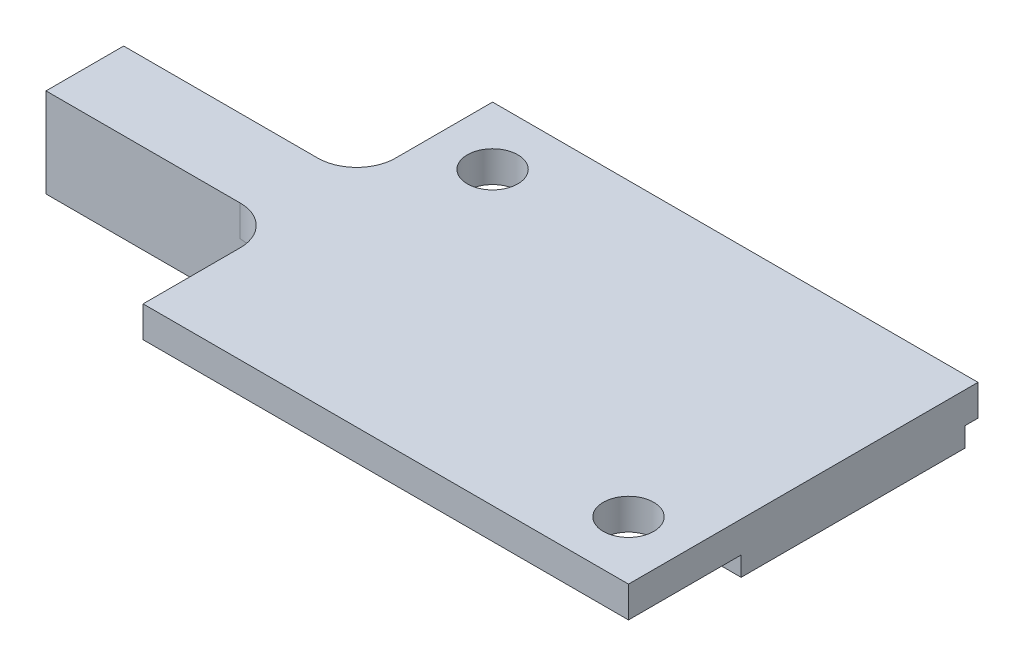
ISO-10303-21;
HEADER;
FILE_DESCRIPTION(('STEP AP214'),'2;1');
FILE_NAME('part.step','',(''),(''),'','','');
FILE_SCHEMA(('AUTOMOTIVE_DESIGN { 1 0 10303 214 1 1 1 1 }'));
ENDSEC;
DATA;
#1=APPLICATION_CONTEXT('core data for automotive mechanical design processes');
#2=APPLICATION_PROTOCOL_DEFINITION('international standard','automotive_design',2000,#1);
#3=PRODUCT_CONTEXT('',#1,'mechanical');
#4=PRODUCT('Part','Part','',(#3));
#5=PRODUCT_RELATED_PRODUCT_CATEGORY('part','',(#4));
#6=PRODUCT_DEFINITION_FORMATION('','',#4);
#7=PRODUCT_DEFINITION_CONTEXT('part definition',#1,'design');
#8=PRODUCT_DEFINITION('design','',#6,#7);
#9=PRODUCT_DEFINITION_SHAPE('','',#8);
#10=(LENGTH_UNIT() NAMED_UNIT(*) SI_UNIT(.MILLI.,.METRE.));
#11=(NAMED_UNIT(*) PLANE_ANGLE_UNIT() SI_UNIT($,.RADIAN.));
#12=(NAMED_UNIT(*) SI_UNIT($,.STERADIAN.) SOLID_ANGLE_UNIT());
#13=UNCERTAINTY_MEASURE_WITH_UNIT(LENGTH_MEASURE(1.E-05),#10,'distance_accuracy_value','');
#14=(GEOMETRIC_REPRESENTATION_CONTEXT(3) GLOBAL_UNCERTAINTY_ASSIGNED_CONTEXT((#13)) GLOBAL_UNIT_ASSIGNED_CONTEXT((#10,
#11,#12)) REPRESENTATION_CONTEXT('',''));
#15=CARTESIAN_POINT('',(0.,0.,0.));
#16=DIRECTION('',(0.,0.,1.));
#17=DIRECTION('',(1.,0.,0.));
#18=AXIS2_PLACEMENT_3D('',#15,#16,#17);
#19=CARTESIAN_POINT('',(0.,0.,0.));
#20=DIRECTION('',(0.,1.,0.));
#21=DIRECTION('',(0.,0.,1.));
#22=AXIS2_PLACEMENT_3D('',#19,#20,#21);
#23=PLANE('',#22);
#24=CARTESIAN_POINT('',(22.,0.,-3.));
#25=DIRECTION('',(0.,1.,0.));
#26=DIRECTION('',(0.,0.,1.));
#27=AXIS2_PLACEMENT_3D('',#24,#25,#26);
#28=CIRCLE('',#27,1.3);
#29=CARTESIAN_POINT('',(22.,0.,-1.7));
#30=VERTEX_POINT('',#29);
#31=EDGE_CURVE('E188',#30,#30,#28,.T.);
#32=ORIENTED_EDGE('',*,*,#31,.T.);
#33=EDGE_LOOP('',(#32));
#34=FACE_BOUND('',#33,.T.);
#35=CARTESIAN_POINT('',(3.,0.,-15.));
#36=DIRECTION('',(0.,1.,0.));
#37=DIRECTION('',(0.,0.,1.));
#38=AXIS2_PLACEMENT_3D('',#35,#36,#37);
#39=CIRCLE('',#38,1.3);
#40=CARTESIAN_POINT('',(3.,0.,-13.7));
#41=VERTEX_POINT('',#40);
#42=EDGE_CURVE('E194',#41,#41,#39,.T.);
#43=ORIENTED_EDGE('',*,*,#42,.T.);
#44=EDGE_LOOP('',(#43));
#45=FACE_BOUND('',#44,.T.);
#46=DIRECTION('',(-1.,0.,0.));
#47=VECTOR('',#46,1.);
#48=CARTESIAN_POINT('',(23.,0.,-5.8));
#49=LINE('',#48,#47);
#50=CARTESIAN_POINT('',(25.,0.,-5.8));
#51=VERTEX_POINT('',#50);
#52=CARTESIAN_POINT('',(23.,0.,-5.8));
#53=VERTEX_POINT('',#52);
#54=EDGE_CURVE('E183',#51,#53,#49,.T.);
#55=ORIENTED_EDGE('',*,*,#54,.F.);
#56=DIRECTION('',(0.,0.,-1.));
#57=VECTOR('',#56,1.);
#58=CARTESIAN_POINT('',(25.,0.,0.));
#59=LINE('',#58,#57);
#60=CARTESIAN_POINT('',(25.,0.,0.));
#61=VERTEX_POINT('',#60);
#62=EDGE_CURVE('E247',#61,#51,#59,.T.);
#63=ORIENTED_EDGE('',*,*,#62,.F.);
#64=DIRECTION('',(1.,0.,0.));
#65=VECTOR('',#64,1.);
#66=CARTESIAN_POINT('',(0.,0.,0.));
#67=LINE('',#66,#65);
#68=CARTESIAN_POINT('',(0.,0.,0.));
#69=VERTEX_POINT('',#68);
#70=EDGE_CURVE('E244',#69,#61,#67,.T.);
#71=ORIENTED_EDGE('',*,*,#70,.F.);
#72=DIRECTION('',(0.,0.,1.));
#73=VECTOR('',#72,1.);
#74=CARTESIAN_POINT('',(0.,0.,0.));
#75=LINE('',#74,#73);
#76=CARTESIAN_POINT('',(0.,0.,-5.));
#77=VERTEX_POINT('',#76);
#78=EDGE_CURVE('E211',#77,#69,#75,.T.);
#79=ORIENTED_EDGE('',*,*,#78,.F.);
#80=CARTESIAN_POINT('',(-2.,0.,-5.));
#81=DIRECTION('',(0.,1.,0.));
#82=DIRECTION('',(0.,0.,1.));
#83=AXIS2_PLACEMENT_3D('',#80,#81,#82);
#84=CIRCLE('',#83,2.);
#85=CARTESIAN_POINT('',(-2.,0.,-7.));
#86=VERTEX_POINT('',#85);
#87=EDGE_CURVE('E282',#77,#86,#84,.T.);
#88=ORIENTED_EDGE('',*,*,#87,.T.);
#89=DIRECTION('',(-1.,0.,0.));
#90=VECTOR('',#89,1.);
#91=CARTESIAN_POINT('',(0.,0.,-7.));
#92=LINE('',#91,#90);
#93=CARTESIAN_POINT('',(0.,0.,-7.));
#94=VERTEX_POINT('',#93);
#95=EDGE_CURVE('E65',#94,#86,#92,.T.);
#96=ORIENTED_EDGE('',*,*,#95,.F.);
#97=DIRECTION('',(0.,0.,1.));
#98=VECTOR('',#97,1.);
#99=CARTESIAN_POINT('',(0.,0.,0.));
#100=LINE('',#99,#98);
#101=CARTESIAN_POINT('',(0.,0.,-11.));
#102=VERTEX_POINT('',#101);
#103=EDGE_CURVE('E212',#102,#94,#100,.T.);
#104=ORIENTED_EDGE('',*,*,#103,.F.);
#105=DIRECTION('',(1.,0.,0.));
#106=VECTOR('',#105,1.);
#107=CARTESIAN_POINT('',(0.,0.,-11.));
#108=LINE('',#107,#106);
#109=CARTESIAN_POINT('',(-2.,0.,-11.));
#110=VERTEX_POINT('',#109);
#111=EDGE_CURVE('E275',#110,#102,#108,.T.);
#112=ORIENTED_EDGE('',*,*,#111,.F.);
#113=CARTESIAN_POINT('',(-2.,0.,-13.));
#114=DIRECTION('',(0.,1.,0.));
#115=DIRECTION('',(0.,0.,1.));
#116=AXIS2_PLACEMENT_3D('',#113,#114,#115);
#117=CIRCLE('',#116,2.);
#118=CARTESIAN_POINT('',(0.,0.,-13.));
#119=VERTEX_POINT('',#118);
#120=EDGE_CURVE('E50',#110,#119,#117,.T.);
#121=ORIENTED_EDGE('',*,*,#120,.T.);
#122=DIRECTION('',(0.,0.,1.));
#123=VECTOR('',#122,1.);
#124=CARTESIAN_POINT('',(0.,0.,-11.));
#125=LINE('',#124,#123);
#126=CARTESIAN_POINT('',(0.,0.,-18.));
#127=VERTEX_POINT('',#126);
#128=EDGE_CURVE('E226',#127,#119,#125,.T.);
#129=ORIENTED_EDGE('',*,*,#128,.F.);
#130=DIRECTION('',(-1.,0.,0.));
#131=VECTOR('',#130,1.);
#132=CARTESIAN_POINT('',(0.,0.,-18.));
#133=LINE('',#132,#131);
#134=CARTESIAN_POINT('',(25.,0.,-18.));
#135=VERTEX_POINT('',#134);
#136=EDGE_CURVE('E250',#135,#127,#133,.T.);
#137=ORIENTED_EDGE('',*,*,#136,.F.);
#138=CARTESIAN_POINT('',(25.,0.,-17.33));
#139=VERTEX_POINT('',#138);
#140=EDGE_CURVE('E246',#139,#135,#59,.T.);
#141=ORIENTED_EDGE('',*,*,#140,.F.);
#142=DIRECTION('',(0.897979896392293,0.,-0.440036482209472));
#143=VECTOR('',#142,1.);
#144=CARTESIAN_POINT('',(25.,0.,-17.33));
#145=LINE('',#144,#143);
#146=CARTESIAN_POINT('',(20.2856055439405,0.,-15.0198084684003));
#147=VERTEX_POINT('',#146);
#148=EDGE_CURVE('E179',#147,#139,#145,.T.);
#149=ORIENTED_EDGE('',*,*,#148,.F.);
#150=DIRECTION('',(-0.662047428307204,0.,-0.74946194211035));
#151=VECTOR('',#150,1.);
#152=CARTESIAN_POINT('',(20.2856055439405,0.,-15.0198084684003));
#153=LINE('',#152,#151);
#154=CARTESIAN_POINT('',(23.,0.,-11.9470145057478));
#155=VERTEX_POINT('',#154);
#156=EDGE_CURVE('E335',#155,#147,#153,.T.);
#157=ORIENTED_EDGE('',*,*,#156,.F.);
#158=DIRECTION('',(0.,0.,-1.));
#159=VECTOR('',#158,1.);
#160=CARTESIAN_POINT('',(23.,0.,-11.9470145057478));
#161=LINE('',#160,#159);
#162=EDGE_CURVE('E339',#53,#155,#161,.T.);
#163=ORIENTED_EDGE('',*,*,#162,.F.);
#164=EDGE_LOOP('',(#55,#63,#71,#79,#88,#96,#104,#112,#121,#129,#137,#141,#149,#157,#163));
#165=FACE_BOUND('',#164,.T.);
#166=ADVANCED_FACE('F42',(#34,#45,#165),#23,.F.);
#167=CARTESIAN_POINT('',(0.,1.6,0.));
#168=DIRECTION('',(1.,0.,0.));
#169=DIRECTION('',(0.,0.,-1.));
#170=AXIS2_PLACEMENT_3D('',#167,#168,#169);
#171=PLANE('',#170);
#172=DIRECTION('',(0.,0.,1.));
#173=VECTOR('',#172,1.);
#174=CARTESIAN_POINT('',(0.,1.6,0.));
#175=LINE('',#174,#173);
#176=CARTESIAN_POINT('',(0.,1.6,-5.));
#177=VERTEX_POINT('',#176);
#178=CARTESIAN_POINT('',(0.,1.6,0.));
#179=VERTEX_POINT('',#178);
#180=EDGE_CURVE('E223',#177,#179,#175,.T.);
#181=ORIENTED_EDGE('',*,*,#180,.F.);
#182=DIRECTION('',(0.,-1.,0.));
#183=VECTOR('',#182,1.);
#184=CARTESIAN_POINT('',(0.,0.,-5.));
#185=LINE('',#184,#183);
#186=EDGE_CURVE('E269',#177,#77,#185,.T.);
#187=ORIENTED_EDGE('',*,*,#186,.T.);
#188=ORIENTED_EDGE('',*,*,#78,.T.);
#189=DIRECTION('',(0.,-1.,0.));
#190=VECTOR('',#189,1.);
#191=CARTESIAN_POINT('',(0.,1.6,0.));
#192=LINE('',#191,#190);
#193=EDGE_CURVE('E266',#179,#69,#192,.T.);
#194=ORIENTED_EDGE('',*,*,#193,.F.);
#195=EDGE_LOOP('',(#181,#187,#188,#194));
#196=FACE_BOUND('',#195,.T.);
#197=ADVANCED_FACE('F318',(#196),#171,.F.);
#198=CARTESIAN_POINT('',(0.,1.6,0.));
#199=DIRECTION('',(0.,0.,-1.));
#200=DIRECTION('',(-1.,0.,0.));
#201=AXIS2_PLACEMENT_3D('',#198,#199,#200);
#202=PLANE('',#201);
#203=ORIENTED_EDGE('',*,*,#70,.T.);
#204=DIRECTION('',(0.,-1.,0.));
#205=VECTOR('',#204,1.);
#206=CARTESIAN_POINT('',(25.,1.6,0.));
#207=LINE('',#206,#205);
#208=CARTESIAN_POINT('',(25.,1.6,0.));
#209=VERTEX_POINT('',#208);
#210=EDGE_CURVE('E263',#209,#61,#207,.T.);
#211=ORIENTED_EDGE('',*,*,#210,.F.);
#212=DIRECTION('',(1.,0.,0.));
#213=VECTOR('',#212,1.);
#214=CARTESIAN_POINT('',(0.,1.6,0.));
#215=LINE('',#214,#213);
#216=EDGE_CURVE('E225',#179,#209,#215,.T.);
#217=ORIENTED_EDGE('',*,*,#216,.F.);
#218=ORIENTED_EDGE('',*,*,#193,.T.);
#219=EDGE_LOOP('',(#203,#211,#217,#218));
#220=FACE_BOUND('',#219,.T.);
#221=ADVANCED_FACE('F325',(#220),#202,.F.);
#222=CARTESIAN_POINT('',(25.,1.6,0.));
#223=DIRECTION('',(-1.,0.,0.));
#224=DIRECTION('',(0.,0.,1.));
#225=AXIS2_PLACEMENT_3D('',#222,#223,#224);
#226=PLANE('',#225);
#227=ORIENTED_EDGE('',*,*,#62,.T.);
#228=DIRECTION('',(0.,1.,0.));
#229=VECTOR('',#228,1.);
#230=CARTESIAN_POINT('',(25.,-1.,-5.8));
#231=LINE('',#230,#229);
#232=CARTESIAN_POINT('',(25.,-1.,-5.8));
#233=VERTEX_POINT('',#232);
#234=EDGE_CURVE('E343',#233,#51,#231,.T.);
#235=ORIENTED_EDGE('',*,*,#234,.F.);
#236=DIRECTION('',(0.,0.,1.));
#237=VECTOR('',#236,1.);
#238=CARTESIAN_POINT('',(25.,-1.,-5.8));
#239=LINE('',#238,#237);
#240=CARTESIAN_POINT('',(25.,-1.,-17.33));
#241=VERTEX_POINT('',#240);
#242=EDGE_CURVE('E176',#241,#233,#239,.T.);
#243=ORIENTED_EDGE('',*,*,#242,.F.);
#244=DIRECTION('',(0.,1.,0.));
#245=VECTOR('',#244,1.);
#246=CARTESIAN_POINT('',(25.,-1.,-17.33));
#247=LINE('',#246,#245);
#248=EDGE_CURVE('E57',#241,#139,#247,.T.);
#249=ORIENTED_EDGE('',*,*,#248,.T.);
#250=ORIENTED_EDGE('',*,*,#140,.T.);
#251=DIRECTION('',(0.,-1.,0.));
#252=VECTOR('',#251,1.);
#253=CARTESIAN_POINT('',(25.,1.6,-18.));
#254=LINE('',#253,#252);
#255=CARTESIAN_POINT('',(25.,1.6,-18.));
#256=VERTEX_POINT('',#255);
#257=EDGE_CURVE('E260',#256,#135,#254,.T.);
#258=ORIENTED_EDGE('',*,*,#257,.F.);
#259=DIRECTION('',(0.,0.,-1.));
#260=VECTOR('',#259,1.);
#261=CARTESIAN_POINT('',(25.,1.6,0.));
#262=LINE('',#261,#260);
#263=EDGE_CURVE('E228',#209,#256,#262,.T.);
#264=ORIENTED_EDGE('',*,*,#263,.F.);
#265=ORIENTED_EDGE('',*,*,#210,.T.);
#266=EDGE_LOOP('',(#227,#235,#243,#249,#250,#258,#264,#265));
#267=FACE_BOUND('',#266,.T.);
#268=ADVANCED_FACE('F329',(#267),#226,.F.);
#269=CARTESIAN_POINT('',(0.,1.6,-18.));
#270=DIRECTION('',(0.,0.,1.));
#271=DIRECTION('',(1.,0.,0.));
#272=AXIS2_PLACEMENT_3D('',#269,#270,#271);
#273=PLANE('',#272);
#274=ORIENTED_EDGE('',*,*,#136,.T.);
#275=DIRECTION('',(0.,-1.,0.));
#276=VECTOR('',#275,1.);
#277=CARTESIAN_POINT('',(0.,1.6,-18.));
#278=LINE('',#277,#276);
#279=CARTESIAN_POINT('',(0.,1.6,-18.));
#280=VERTEX_POINT('',#279);
#281=EDGE_CURVE('E257',#280,#127,#278,.T.);
#282=ORIENTED_EDGE('',*,*,#281,.F.);
#283=DIRECTION('',(-1.,0.,0.));
#284=VECTOR('',#283,1.);
#285=CARTESIAN_POINT('',(0.,1.6,-18.));
#286=LINE('',#285,#284);
#287=EDGE_CURVE('E230',#256,#280,#286,.T.);
#288=ORIENTED_EDGE('',*,*,#287,.F.);
#289=ORIENTED_EDGE('',*,*,#257,.T.);
#290=EDGE_LOOP('',(#274,#282,#288,#289));
#291=FACE_BOUND('',#290,.T.);
#292=ADVANCED_FACE('F332',(#291),#273,.F.);
#293=CARTESIAN_POINT('',(0.,1.6,-11.));
#294=DIRECTION('',(1.,0.,0.));
#295=DIRECTION('',(0.,0.,-1.));
#296=AXIS2_PLACEMENT_3D('',#293,#294,#295);
#297=PLANE('',#296);
#298=ORIENTED_EDGE('',*,*,#128,.T.);
#299=DIRECTION('',(0.,-1.,0.));
#300=VECTOR('',#299,1.);
#301=CARTESIAN_POINT('',(0.,1.6,-13.));
#302=LINE('',#301,#300);
#303=CARTESIAN_POINT('',(0.,1.6,-13.));
#304=VERTEX_POINT('',#303);
#305=EDGE_CURVE('E280',#119,#304,#302,.F.);
#306=ORIENTED_EDGE('',*,*,#305,.T.);
#307=DIRECTION('',(0.,0.,1.));
#308=VECTOR('',#307,1.);
#309=CARTESIAN_POINT('',(0.,1.6,-11.));
#310=LINE('',#309,#308);
#311=EDGE_CURVE('E232',#280,#304,#310,.T.);
#312=ORIENTED_EDGE('',*,*,#311,.F.);
#313=ORIENTED_EDGE('',*,*,#281,.T.);
#314=EDGE_LOOP('',(#298,#306,#312,#313));
#315=FACE_BOUND('',#314,.T.);
#316=ADVANCED_FACE('F292',(#315),#297,.F.);
#317=CARTESIAN_POINT('',(0.,1.6,-11.));
#318=DIRECTION('',(0.,0.,1.));
#319=DIRECTION('',(1.,0.,0.));
#320=AXIS2_PLACEMENT_3D('',#317,#318,#319);
#321=PLANE('',#320);
#322=DIRECTION('',(-1.,0.,0.));
#323=VECTOR('',#322,1.);
#324=CARTESIAN_POINT('',(0.,1.6,-11.));
#325=LINE('',#324,#323);
#326=CARTESIAN_POINT('',(-2.,1.6,-11.));
#327=VERTEX_POINT('',#326);
#328=CARTESIAN_POINT('',(-12.,1.6,-11.));
#329=VERTEX_POINT('',#328);
#330=EDGE_CURVE('E235',#327,#329,#325,.T.);
#331=ORIENTED_EDGE('',*,*,#330,.F.);
#332=DIRECTION('',(0.,-1.,0.));
#333=VECTOR('',#332,1.);
#334=CARTESIAN_POINT('',(-2.,0.,-11.));
#335=LINE('',#334,#333);
#336=EDGE_CURVE('E277',#327,#110,#335,.T.);
#337=ORIENTED_EDGE('',*,*,#336,.T.);
#338=ORIENTED_EDGE('',*,*,#111,.T.);
#339=DIRECTION('',(0.,1.,0.));
#340=VECTOR('',#339,1.);
#341=CARTESIAN_POINT('',(0.,0.,-11.));
#342=LINE('',#341,#340);
#343=CARTESIAN_POINT('',(0.,-3.,-11.));
#344=VERTEX_POINT('',#343);
#345=EDGE_CURVE('E216',#344,#102,#342,.T.);
#346=ORIENTED_EDGE('',*,*,#345,.F.);
#347=DIRECTION('',(-1.,0.,0.));
#348=VECTOR('',#347,1.);
#349=CARTESIAN_POINT('',(5.,-3.,-11.));
#350=LINE('',#349,#348);
#351=CARTESIAN_POINT('',(-12.,-3.,-11.));
#352=VERTEX_POINT('',#351);
#353=EDGE_CURVE('E206',#344,#352,#350,.T.);
#354=ORIENTED_EDGE('',*,*,#353,.T.);
#355=DIRECTION('',(0.,-1.,0.));
#356=VECTOR('',#355,1.);
#357=CARTESIAN_POINT('',(-12.,1.6,-11.));
#358=LINE('',#357,#356);
#359=EDGE_CURVE('E255',#329,#352,#358,.T.);
#360=ORIENTED_EDGE('',*,*,#359,.F.);
#361=EDGE_LOOP('',(#331,#337,#338,#346,#354,#360));
#362=FACE_BOUND('',#361,.T.);
#363=ADVANCED_FACE('F301',(#362),#321,.F.);
#364=CARTESIAN_POINT('',(-12.,1.6,-7.));
#365=DIRECTION('',(1.,0.,0.));
#366=DIRECTION('',(0.,0.,-1.));
#367=AXIS2_PLACEMENT_3D('',#364,#365,#366);
#368=PLANE('',#367);
#369=ORIENTED_EDGE('',*,*,#359,.T.);
#370=CARTESIAN_POINT('',(-12.,-3.,-9.));
#371=DIRECTION('',(-1.,0.,0.));
#372=DIRECTION('',(0.,0.,1.));
#373=AXIS2_PLACEMENT_3D('',#370,#371,#372);
#374=CIRCLE('',#373,2.);
#375=CARTESIAN_POINT('',(-12.,-3.,-7.));
#376=VERTEX_POINT('',#375);
#377=EDGE_CURVE('E203',#376,#352,#374,.T.);
#378=ORIENTED_EDGE('',*,*,#377,.F.);
#379=DIRECTION('',(0.,-1.,0.));
#380=VECTOR('',#379,1.);
#381=CARTESIAN_POINT('',(-12.,1.6,-7.));
#382=LINE('',#381,#380);
#383=CARTESIAN_POINT('',(-12.,1.6,-7.));
#384=VERTEX_POINT('',#383);
#385=EDGE_CURVE('E242',#384,#376,#382,.T.);
#386=ORIENTED_EDGE('',*,*,#385,.F.);
#387=DIRECTION('',(0.,0.,1.));
#388=VECTOR('',#387,1.);
#389=CARTESIAN_POINT('',(-12.,1.6,-7.));
#390=LINE('',#389,#388);
#391=EDGE_CURVE('E237',#329,#384,#390,.T.);
#392=ORIENTED_EDGE('',*,*,#391,.F.);
#393=EDGE_LOOP('',(#369,#378,#386,#392));
#394=FACE_BOUND('',#393,.T.);
#395=ADVANCED_FACE('F307',(#394),#368,.F.);
#396=CARTESIAN_POINT('',(0.,1.6,-7.));
#397=DIRECTION('',(0.,0.,-1.));
#398=DIRECTION('',(-1.,0.,0.));
#399=AXIS2_PLACEMENT_3D('',#396,#397,#398);
#400=PLANE('',#399);
#401=DIRECTION('',(0.,1.,0.));
#402=VECTOR('',#401,1.);
#403=CARTESIAN_POINT('',(0.,0.,-7.));
#404=LINE('',#403,#402);
#405=CARTESIAN_POINT('',(0.,-3.,-7.));
#406=VERTEX_POINT('',#405);
#407=EDGE_CURVE('E197',#406,#94,#404,.T.);
#408=ORIENTED_EDGE('',*,*,#407,.T.);
#409=ORIENTED_EDGE('',*,*,#95,.T.);
#410=DIRECTION('',(0.,-1.,0.));
#411=VECTOR('',#410,1.);
#412=CARTESIAN_POINT('',(-2.,1.6,-7.));
#413=LINE('',#412,#411);
#414=CARTESIAN_POINT('',(-2.,1.6,-7.));
#415=VERTEX_POINT('',#414);
#416=EDGE_CURVE('E272',#86,#415,#413,.F.);
#417=ORIENTED_EDGE('',*,*,#416,.T.);
#418=DIRECTION('',(1.,0.,0.));
#419=VECTOR('',#418,1.);
#420=CARTESIAN_POINT('',(0.,1.6,-7.));
#421=LINE('',#420,#419);
#422=EDGE_CURVE('E239',#384,#415,#421,.T.);
#423=ORIENTED_EDGE('',*,*,#422,.F.);
#424=ORIENTED_EDGE('',*,*,#385,.T.);
#425=DIRECTION('',(-1.,0.,0.));
#426=VECTOR('',#425,1.);
#427=CARTESIAN_POINT('',(5.,-3.,-7.));
#428=LINE('',#427,#426);
#429=EDGE_CURVE('E207',#406,#376,#428,.T.);
#430=ORIENTED_EDGE('',*,*,#429,.F.);
#431=EDGE_LOOP('',(#408,#409,#417,#423,#424,#430));
#432=FACE_BOUND('',#431,.T.);
#433=ADVANCED_FACE('F374',(#432),#400,.F.);
#434=CARTESIAN_POINT('',(0.,1.6,0.));
#435=DIRECTION('',(0.,1.,0.));
#436=DIRECTION('',(0.,0.,1.));
#437=AXIS2_PLACEMENT_3D('',#434,#435,#436);
#438=PLANE('',#437);
#439=CARTESIAN_POINT('',(3.,1.6,-15.));
#440=DIRECTION('',(0.,1.,0.));
#441=DIRECTION('',(0.,0.,1.));
#442=AXIS2_PLACEMENT_3D('',#439,#440,#441);
#443=CIRCLE('',#442,1.3);
#444=CARTESIAN_POINT('',(3.,1.6,-13.7));
#445=VERTEX_POINT('',#444);
#446=EDGE_CURVE('E198',#445,#445,#443,.T.);
#447=ORIENTED_EDGE('',*,*,#446,.F.);
#448=EDGE_LOOP('',(#447));
#449=FACE_BOUND('',#448,.T.);
#450=CARTESIAN_POINT('',(22.,1.6,-3.));
#451=DIRECTION('',(0.,1.,0.));
#452=DIRECTION('',(0.,0.,1.));
#453=AXIS2_PLACEMENT_3D('',#450,#451,#452);
#454=CIRCLE('',#453,1.3);
#455=CARTESIAN_POINT('',(22.,1.6,-1.7));
#456=VERTEX_POINT('',#455);
#457=EDGE_CURVE('E185',#456,#456,#454,.T.);
#458=ORIENTED_EDGE('',*,*,#457,.F.);
#459=EDGE_LOOP('',(#458));
#460=FACE_BOUND('',#459,.T.);
#461=ORIENTED_EDGE('',*,*,#422,.T.);
#462=CARTESIAN_POINT('',(-2.,1.6,-5.));
#463=DIRECTION('',(0.,1.,0.));
#464=DIRECTION('',(0.,0.,1.));
#465=AXIS2_PLACEMENT_3D('',#462,#463,#464);
#466=CIRCLE('',#465,2.);
#467=EDGE_CURVE('E284',#415,#177,#466,.F.);
#468=ORIENTED_EDGE('',*,*,#467,.T.);
#469=ORIENTED_EDGE('',*,*,#180,.T.);
#470=ORIENTED_EDGE('',*,*,#216,.T.);
#471=ORIENTED_EDGE('',*,*,#263,.T.);
#472=ORIENTED_EDGE('',*,*,#287,.T.);
#473=ORIENTED_EDGE('',*,*,#311,.T.);
#474=CARTESIAN_POINT('',(-2.,1.6,-13.));
#475=DIRECTION('',(0.,1.,0.));
#476=DIRECTION('',(0.,0.,1.));
#477=AXIS2_PLACEMENT_3D('',#474,#475,#476);
#478=CIRCLE('',#477,2.);
#479=EDGE_CURVE('E11',#304,#327,#478,.F.);
#480=ORIENTED_EDGE('',*,*,#479,.T.);
#481=ORIENTED_EDGE('',*,*,#330,.T.);
#482=ORIENTED_EDGE('',*,*,#391,.T.);
#483=EDGE_LOOP('',(#461,#468,#469,#470,#471,#472,#473,#480,#481,#482));
#484=FACE_BOUND('',#483,.T.);
#485=ADVANCED_FACE('F298',(#449,#460,#484),#438,.T.);
#486=CARTESIAN_POINT('',(5.,-3.,-9.));
#487=DIRECTION('',(-1.,0.,0.));
#488=DIRECTION('',(0.,0.,1.));
#489=AXIS2_PLACEMENT_3D('',#486,#487,#488);
#490=CYLINDRICAL_SURFACE('',#489,2.);
#491=CARTESIAN_POINT('',(0.,-3.,-9.));
#492=DIRECTION('',(1.,0.,0.));
#493=DIRECTION('',(0.,0.,-1.));
#494=AXIS2_PLACEMENT_3D('',#491,#492,#493);
#495=CIRCLE('',#494,2.);
#496=EDGE_CURVE('E208',#406,#344,#495,.F.);
#497=ORIENTED_EDGE('',*,*,#496,.F.);
#498=ORIENTED_EDGE('',*,*,#429,.T.);
#499=ORIENTED_EDGE('',*,*,#377,.T.);
#500=ORIENTED_EDGE('',*,*,#353,.F.);
#501=EDGE_LOOP('',(#497,#498,#499,#500));
#502=FACE_BOUND('',#501,.T.);
#503=ADVANCED_FACE('F407',(#502),#490,.F.);
#504=CARTESIAN_POINT('',(0.,1.6,-11.));
#505=DIRECTION('',(1.,0.,0.));
#506=DIRECTION('',(0.,0.,-1.));
#507=AXIS2_PLACEMENT_3D('',#504,#505,#506);
#508=PLANE('',#507);
#509=ORIENTED_EDGE('',*,*,#345,.T.);
#510=ORIENTED_EDGE('',*,*,#103,.T.);
#511=ORIENTED_EDGE('',*,*,#407,.F.);
#512=ORIENTED_EDGE('',*,*,#496,.T.);
#513=EDGE_LOOP('',(#509,#510,#511,#512));
#514=FACE_BOUND('',#513,.T.);
#515=ADVANCED_FACE('F400',(#514),#508,.T.);
#516=CARTESIAN_POINT('',(22.,0.,-3.));
#517=DIRECTION('',(0.,1.,0.));
#518=DIRECTION('',(0.,0.,1.));
#519=AXIS2_PLACEMENT_3D('',#516,#517,#518);
#520=CYLINDRICAL_SURFACE('',#519,1.3);
#521=ORIENTED_EDGE('',*,*,#31,.F.);
#522=EDGE_LOOP('',(#521));
#523=FACE_BOUND('',#522,.T.);
#524=ORIENTED_EDGE('',*,*,#457,.T.);
#525=EDGE_LOOP('',(#524));
#526=FACE_BOUND('',#525,.T.);
#527=ADVANCED_FACE('F394',(#523,#526),#520,.F.);
#528=CARTESIAN_POINT('',(3.,0.,-15.));
#529=DIRECTION('',(0.,1.,0.));
#530=DIRECTION('',(0.,0.,1.));
#531=AXIS2_PLACEMENT_3D('',#528,#529,#530);
#532=CYLINDRICAL_SURFACE('',#531,1.3);
#533=ORIENTED_EDGE('',*,*,#42,.F.);
#534=EDGE_LOOP('',(#533));
#535=FACE_BOUND('',#534,.T.);
#536=ORIENTED_EDGE('',*,*,#446,.T.);
#537=EDGE_LOOP('',(#536));
#538=FACE_BOUND('',#537,.T.);
#539=ADVANCED_FACE('F389',(#535,#538),#532,.F.);
#540=CARTESIAN_POINT('',(-2.,1.6,-5.));
#541=DIRECTION('',(0.,1.,0.));
#542=DIRECTION('',(0.,0.,1.));
#543=AXIS2_PLACEMENT_3D('',#540,#541,#542);
#544=CYLINDRICAL_SURFACE('',#543,2.);
#545=ORIENTED_EDGE('',*,*,#467,.F.);
#546=ORIENTED_EDGE('',*,*,#416,.F.);
#547=ORIENTED_EDGE('',*,*,#87,.F.);
#548=ORIENTED_EDGE('',*,*,#186,.F.);
#549=EDGE_LOOP('',(#545,#546,#547,#548));
#550=FACE_BOUND('',#549,.T.);
#551=ADVANCED_FACE('F315',(#550),#544,.F.);
#552=CARTESIAN_POINT('',(-2.,1.6,-13.));
#553=DIRECTION('',(0.,1.,0.));
#554=DIRECTION('',(0.,0.,1.));
#555=AXIS2_PLACEMENT_3D('',#552,#553,#554);
#556=CYLINDRICAL_SURFACE('',#555,2.);
#557=ORIENTED_EDGE('',*,*,#479,.F.);
#558=ORIENTED_EDGE('',*,*,#305,.F.);
#559=ORIENTED_EDGE('',*,*,#120,.F.);
#560=ORIENTED_EDGE('',*,*,#336,.F.);
#561=EDGE_LOOP('',(#557,#558,#559,#560));
#562=FACE_BOUND('',#561,.T.);
#563=ADVANCED_FACE('F44',(#562),#556,.F.);
#564=CARTESIAN_POINT('',(23.,-1.,-5.8));
#565=DIRECTION('',(0.,0.,-1.));
#566=DIRECTION('',(-1.,0.,0.));
#567=AXIS2_PLACEMENT_3D('',#564,#565,#566);
#568=PLANE('',#567);
#569=ORIENTED_EDGE('',*,*,#54,.T.);
#570=DIRECTION('',(0.,1.,0.));
#571=VECTOR('',#570,1.);
#572=CARTESIAN_POINT('',(23.,-1.,-5.8));
#573=LINE('',#572,#571);
#574=CARTESIAN_POINT('',(23.,-1.,-5.8));
#575=VERTEX_POINT('',#574);
#576=EDGE_CURVE('E165',#575,#53,#573,.T.);
#577=ORIENTED_EDGE('',*,*,#576,.F.);
#578=DIRECTION('',(-1.,0.,0.));
#579=VECTOR('',#578,1.);
#580=CARTESIAN_POINT('',(23.,-1.,-5.8));
#581=LINE('',#580,#579);
#582=EDGE_CURVE('E172',#233,#575,#581,.T.);
#583=ORIENTED_EDGE('',*,*,#582,.F.);
#584=ORIENTED_EDGE('',*,*,#234,.T.);
#585=EDGE_LOOP('',(#569,#577,#583,#584));
#586=FACE_BOUND('',#585,.T.);
#587=ADVANCED_FACE('F181',(#586),#568,.F.);
#588=CARTESIAN_POINT('',(23.,-1.,-11.9470145057478));
#589=DIRECTION('',(1.,0.,0.));
#590=DIRECTION('',(0.,0.,-1.));
#591=AXIS2_PLACEMENT_3D('',#588,#589,#590);
#592=PLANE('',#591);
#593=ORIENTED_EDGE('',*,*,#162,.T.);
#594=DIRECTION('',(0.,1.,0.));
#595=VECTOR('',#594,1.);
#596=CARTESIAN_POINT('',(23.,-1.,-11.9470145057478));
#597=LINE('',#596,#595);
#598=CARTESIAN_POINT('',(23.,-1.,-11.9470145057478));
#599=VERTEX_POINT('',#598);
#600=EDGE_CURVE('E168',#599,#155,#597,.T.);
#601=ORIENTED_EDGE('',*,*,#600,.F.);
#602=DIRECTION('',(0.,0.,-1.));
#603=VECTOR('',#602,1.);
#604=CARTESIAN_POINT('',(23.,-1.,-11.9470145057478));
#605=LINE('',#604,#603);
#606=EDGE_CURVE('E161',#575,#599,#605,.T.);
#607=ORIENTED_EDGE('',*,*,#606,.F.);
#608=ORIENTED_EDGE('',*,*,#576,.T.);
#609=EDGE_LOOP('',(#593,#601,#607,#608));
#610=FACE_BOUND('',#609,.T.);
#611=ADVANCED_FACE('F163',(#610),#592,.F.);
#612=CARTESIAN_POINT('',(20.2856055439405,-1.,-15.0198084684003));
#613=DIRECTION('',(0.74946194211035,0.,-0.662047428307204));
#614=DIRECTION('',(-0.662047428307204,0.,-0.74946194211035));
#615=AXIS2_PLACEMENT_3D('',#612,#613,#614);
#616=PLANE('',#615);
#617=ORIENTED_EDGE('',*,*,#156,.T.);
#618=DIRECTION('',(0.,1.,0.));
#619=VECTOR('',#618,1.);
#620=CARTESIAN_POINT('',(20.2856055439405,-1.,-15.0198084684003));
#621=LINE('',#620,#619);
#622=CARTESIAN_POINT('',(20.2856055439405,-1.,-15.0198084684003));
#623=VERTEX_POINT('',#622);
#624=EDGE_CURVE('E190',#623,#147,#621,.T.);
#625=ORIENTED_EDGE('',*,*,#624,.F.);
#626=DIRECTION('',(-0.662047428307204,0.,-0.74946194211035));
#627=VECTOR('',#626,1.);
#628=CARTESIAN_POINT('',(20.2856055439405,-1.,-15.0198084684003));
#629=LINE('',#628,#627);
#630=EDGE_CURVE('E171',#599,#623,#629,.T.);
#631=ORIENTED_EDGE('',*,*,#630,.F.);
#632=ORIENTED_EDGE('',*,*,#600,.T.);
#633=EDGE_LOOP('',(#617,#625,#631,#632));
#634=FACE_BOUND('',#633,.T.);
#635=ADVANCED_FACE('F350',(#634),#616,.F.);
#636=CARTESIAN_POINT('',(25.,-1.,-17.33));
#637=DIRECTION('',(0.440036482209473,0.,0.897979896392293));
#638=DIRECTION('',(0.897979896392293,0.,-0.440036482209472));
#639=AXIS2_PLACEMENT_3D('',#636,#637,#638);
#640=PLANE('',#639);
#641=ORIENTED_EDGE('',*,*,#148,.T.);
#642=ORIENTED_EDGE('',*,*,#248,.F.);
#643=DIRECTION('',(0.897979896392293,0.,-0.440036482209472));
#644=VECTOR('',#643,1.);
#645=CARTESIAN_POINT('',(25.,-1.,-17.33));
#646=LINE('',#645,#644);
#647=EDGE_CURVE('E348',#623,#241,#646,.T.);
#648=ORIENTED_EDGE('',*,*,#647,.F.);
#649=ORIENTED_EDGE('',*,*,#624,.T.);
#650=EDGE_LOOP('',(#641,#642,#648,#649));
#651=FACE_BOUND('',#650,.T.);
#652=ADVANCED_FACE('F347',(#651),#640,.F.);
#653=CARTESIAN_POINT('',(0.,-1.,0.));
#654=DIRECTION('',(0.,1.,0.));
#655=DIRECTION('',(0.,0.,1.));
#656=AXIS2_PLACEMENT_3D('',#653,#654,#655);
#657=PLANE('',#656);
#658=ORIENTED_EDGE('',*,*,#582,.T.);
#659=ORIENTED_EDGE('',*,*,#606,.T.);
#660=ORIENTED_EDGE('',*,*,#630,.T.);
#661=ORIENTED_EDGE('',*,*,#647,.T.);
#662=ORIENTED_EDGE('',*,*,#242,.T.);
#663=EDGE_LOOP('',(#658,#659,#660,#661,#662));
#664=FACE_BOUND('',#663,.T.);
#665=ADVANCED_FACE('F175',(#664),#657,.F.);
#666=CLOSED_SHELL('',(#166,#197,#221,#268,#292,#316,#363,#395,#433,#485,#503,#515,#527,#539,
#551,#563,#587,#611,#635,#652,#665));
#667=MANIFOLD_SOLID_BREP('B2',#666);
#668=ADVANCED_BREP_SHAPE_REPRESENTATION('',(#18,#667),#14);
#669=SHAPE_DEFINITION_REPRESENTATION(#9,#668);
ENDSEC;
END-ISO-10303-21;
